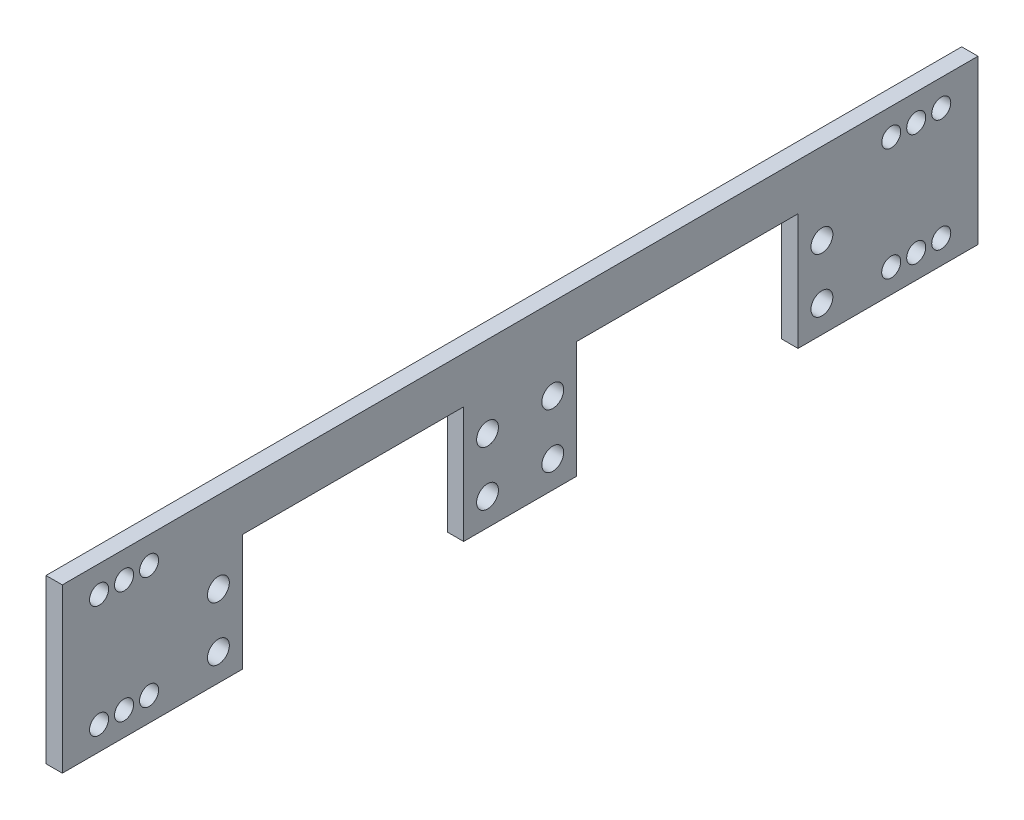
ISO-10303-21;
HEADER;
FILE_DESCRIPTION(('STEP AP214'),'2;1');
FILE_NAME('part.step','',(''),(''),'','','');
FILE_SCHEMA(('AUTOMOTIVE_DESIGN { 1 0 10303 214 1 1 1 1 }'));
ENDSEC;
DATA;
#1=APPLICATION_CONTEXT('core data for automotive mechanical design processes');
#2=APPLICATION_PROTOCOL_DEFINITION('international standard','automotive_design',2000,#1);
#3=PRODUCT_CONTEXT('',#1,'mechanical');
#4=PRODUCT('Part','Part','',(#3));
#5=PRODUCT_RELATED_PRODUCT_CATEGORY('part','',(#4));
#6=PRODUCT_DEFINITION_FORMATION('','',#4);
#7=PRODUCT_DEFINITION_CONTEXT('part definition',#1,'design');
#8=PRODUCT_DEFINITION('design','',#6,#7);
#9=PRODUCT_DEFINITION_SHAPE('','',#8);
#10=(LENGTH_UNIT() NAMED_UNIT(*) SI_UNIT(.MILLI.,.METRE.));
#11=(NAMED_UNIT(*) PLANE_ANGLE_UNIT() SI_UNIT($,.RADIAN.));
#12=(NAMED_UNIT(*) SI_UNIT($,.STERADIAN.) SOLID_ANGLE_UNIT());
#13=UNCERTAINTY_MEASURE_WITH_UNIT(LENGTH_MEASURE(1.E-05),#10,'distance_accuracy_value','');
#14=(GEOMETRIC_REPRESENTATION_CONTEXT(3) GLOBAL_UNCERTAINTY_ASSIGNED_CONTEXT((#13)) GLOBAL_UNIT_ASSIGNED_CONTEXT((#10,
#11,#12)) REPRESENTATION_CONTEXT('',''));
#15=CARTESIAN_POINT('',(0.,0.,0.));
#16=DIRECTION('',(0.,0.,1.));
#17=DIRECTION('',(1.,0.,0.));
#18=AXIS2_PLACEMENT_3D('',#15,#16,#17);
#19=CARTESIAN_POINT('',(3.,21.4565030456069,0.));
#20=DIRECTION('',(0.,1.,0.));
#21=DIRECTION('',(0.,0.,1.));
#22=AXIS2_PLACEMENT_3D('',#19,#20,#21);
#23=PLANE('',#22);
#24=DIRECTION('',(0.,0.,-1.));
#25=VECTOR('',#24,1.);
#26=CARTESIAN_POINT('',(0.,21.4565030456069,0.));
#27=LINE('',#26,#25);
#28=CARTESIAN_POINT('',(0.,21.4565030456069,-10.3935364042109));
#29=VERTEX_POINT('',#28);
#30=CARTESIAN_POINT('',(0.,21.4565030456069,-51.1064635957811));
#31=VERTEX_POINT('',#30);
#32=EDGE_CURVE('E255',#29,#31,#27,.T.);
#33=ORIENTED_EDGE('',*,*,#32,.T.);
#34=DIRECTION('',(-1.,0.,0.));
#35=VECTOR('',#34,1.);
#36=CARTESIAN_POINT('',(3.,21.4565030456069,-51.1064635957811));
#37=LINE('',#36,#35);
#38=CARTESIAN_POINT('',(3.,21.4565030456069,-51.1064635957811));
#39=VERTEX_POINT('',#38);
#40=EDGE_CURVE('E11',#39,#31,#37,.T.);
#41=ORIENTED_EDGE('',*,*,#40,.F.);
#42=DIRECTION('',(0.,0.,-1.));
#43=VECTOR('',#42,1.);
#44=CARTESIAN_POINT('',(3.,21.4565030456069,0.));
#45=LINE('',#44,#43);
#46=CARTESIAN_POINT('',(3.,21.4565030456069,-10.3935364042109));
#47=VERTEX_POINT('',#46);
#48=EDGE_CURVE('E115',#47,#39,#45,.T.);
#49=ORIENTED_EDGE('',*,*,#48,.F.);
#50=DIRECTION('',(-1.,0.,0.));
#51=VECTOR('',#50,1.);
#52=CARTESIAN_POINT('',(3.,21.4565030456069,-10.3935364042109));
#53=LINE('',#52,#51);
#54=EDGE_CURVE('E198',#47,#29,#53,.T.);
#55=ORIENTED_EDGE('',*,*,#54,.T.);
#56=EDGE_LOOP('',(#33,#41,#49,#55));
#57=FACE_BOUND('',#56,.T.);
#58=ADVANCED_FACE('F46',(#57),#23,.F.);
#59=CARTESIAN_POINT('',(3.,0.,-51.1064635957811));
#60=DIRECTION('',(0.,0.,1.));
#61=DIRECTION('',(1.,0.,0.));
#62=AXIS2_PLACEMENT_3D('',#59,#60,#61);
#63=PLANE('',#62);
#64=DIRECTION('',(0.,1.,0.));
#65=VECTOR('',#64,1.);
#66=CARTESIAN_POINT('',(0.,0.,-51.1064635957811));
#67=LINE('',#66,#65);
#68=CARTESIAN_POINT('',(0.,0.,-51.1064635957811));
#69=VERTEX_POINT('',#68);
#70=EDGE_CURVE('E259',#69,#31,#67,.T.);
#71=ORIENTED_EDGE('',*,*,#70,.F.);
#72=DIRECTION('',(-1.,0.,0.));
#73=VECTOR('',#72,1.);
#74=CARTESIAN_POINT('',(3.,0.,-51.1064635957811));
#75=LINE('',#74,#73);
#76=CARTESIAN_POINT('',(3.,0.,-51.1064635957811));
#77=VERTEX_POINT('',#76);
#78=EDGE_CURVE('E56',#77,#69,#75,.T.);
#79=ORIENTED_EDGE('',*,*,#78,.F.);
#80=DIRECTION('',(0.,1.,0.));
#81=VECTOR('',#80,1.);
#82=CARTESIAN_POINT('',(3.,0.,-51.1064635957811));
#83=LINE('',#82,#81);
#84=EDGE_CURVE('E362',#77,#39,#83,.T.);
#85=ORIENTED_EDGE('',*,*,#84,.T.);
#86=ORIENTED_EDGE('',*,*,#40,.T.);
#87=EDGE_LOOP('',(#71,#79,#85,#86));
#88=FACE_BOUND('',#87,.T.);
#89=ADVANCED_FACE('F361',(#88),#63,.T.);
#90=CARTESIAN_POINT('',(3.,0.,0.));
#91=DIRECTION('',(0.,1.,0.));
#92=DIRECTION('',(0.,0.,1.));
#93=AXIS2_PLACEMENT_3D('',#90,#91,#92);
#94=PLANE('',#93);
#95=DIRECTION('',(0.,0.,-1.));
#96=VECTOR('',#95,1.);
#97=CARTESIAN_POINT('',(0.,0.,0.));
#98=LINE('',#97,#96);
#99=CARTESIAN_POINT('',(0.,0.,-84.2099999999956));
#100=VERTEX_POINT('',#99);
#101=EDGE_CURVE('E263',#69,#100,#98,.T.);
#102=ORIENTED_EDGE('',*,*,#101,.T.);
#103=DIRECTION('',(-1.,0.,0.));
#104=VECTOR('',#103,1.);
#105=CARTESIAN_POINT('',(3.,0.,-84.2099999999956));
#106=LINE('',#105,#104);
#107=CARTESIAN_POINT('',(3.,0.,-84.2099999999956));
#108=VERTEX_POINT('',#107);
#109=EDGE_CURVE('E342',#108,#100,#106,.T.);
#110=ORIENTED_EDGE('',*,*,#109,.F.);
#111=DIRECTION('',(0.,0.,-1.));
#112=VECTOR('',#111,1.);
#113=CARTESIAN_POINT('',(3.,0.,0.));
#114=LINE('',#113,#112);
#115=EDGE_CURVE('E352',#77,#108,#114,.T.);
#116=ORIENTED_EDGE('',*,*,#115,.F.);
#117=ORIENTED_EDGE('',*,*,#78,.T.);
#118=EDGE_LOOP('',(#102,#110,#116,#117));
#119=FACE_BOUND('',#118,.T.);
#120=ADVANCED_FACE('F350',(#119),#94,.F.);
#121=CARTESIAN_POINT('',(3.,0.,-84.2099999999956));
#122=DIRECTION('',(0.,0.,1.));
#123=DIRECTION('',(1.,0.,0.));
#124=AXIS2_PLACEMENT_3D('',#121,#122,#123);
#125=PLANE('',#124);
#126=DIRECTION('',(0.,1.,0.));
#127=VECTOR('',#126,1.);
#128=CARTESIAN_POINT('',(0.,0.,-84.2099999999956));
#129=LINE('',#128,#127);
#130=CARTESIAN_POINT('',(0.,29.9999999999999,-84.2099999999956));
#131=VERTEX_POINT('',#130);
#132=EDGE_CURVE('E266',#100,#131,#129,.T.);
#133=ORIENTED_EDGE('',*,*,#132,.T.);
#134=DIRECTION('',(-1.,0.,0.));
#135=VECTOR('',#134,1.);
#136=CARTESIAN_POINT('',(3.,29.9999999999999,-84.2099999999956));
#137=LINE('',#136,#135);
#138=CARTESIAN_POINT('',(3.,29.9999999999999,-84.2099999999956));
#139=VERTEX_POINT('',#138);
#140=EDGE_CURVE('E339',#139,#131,#137,.T.);
#141=ORIENTED_EDGE('',*,*,#140,.F.);
#142=DIRECTION('',(0.,1.,0.));
#143=VECTOR('',#142,1.);
#144=CARTESIAN_POINT('',(3.,0.,-84.2099999999956));
#145=LINE('',#144,#143);
#146=EDGE_CURVE('E394',#108,#139,#145,.T.);
#147=ORIENTED_EDGE('',*,*,#146,.F.);
#148=ORIENTED_EDGE('',*,*,#109,.T.);
#149=EDGE_LOOP('',(#133,#141,#147,#148));
#150=FACE_BOUND('',#149,.T.);
#151=ADVANCED_FACE('F393',(#150),#125,.F.);
#152=CARTESIAN_POINT('',(3.,29.9999999999999,0.));
#153=DIRECTION('',(0.,1.,0.));
#154=DIRECTION('',(0.,0.,1.));
#155=AXIS2_PLACEMENT_3D('',#152,#153,#154);
#156=PLANE('',#155);
#157=DIRECTION('',(0.,0.,-1.));
#158=VECTOR('',#157,1.);
#159=CARTESIAN_POINT('',(0.,29.9999999999999,0.));
#160=LINE('',#159,#158);
#161=CARTESIAN_POINT('',(0.,29.9999999999999,84.2100000000044));
#162=VERTEX_POINT('',#161);
#163=EDGE_CURVE('E270',#162,#131,#160,.T.);
#164=ORIENTED_EDGE('',*,*,#163,.F.);
#165=DIRECTION('',(-1.,0.,0.));
#166=VECTOR('',#165,1.);
#167=CARTESIAN_POINT('',(3.,29.9999999999999,84.2100000000044));
#168=LINE('',#167,#166);
#169=CARTESIAN_POINT('',(3.,29.9999999999999,84.2100000000044));
#170=VERTEX_POINT('',#169);
#171=EDGE_CURVE('E336',#170,#162,#168,.T.);
#172=ORIENTED_EDGE('',*,*,#171,.F.);
#173=DIRECTION('',(0.,0.,-1.));
#174=VECTOR('',#173,1.);
#175=CARTESIAN_POINT('',(3.,29.9999999999999,0.));
#176=LINE('',#175,#174);
#177=EDGE_CURVE('E390',#170,#139,#176,.T.);
#178=ORIENTED_EDGE('',*,*,#177,.T.);
#179=ORIENTED_EDGE('',*,*,#140,.T.);
#180=EDGE_LOOP('',(#164,#172,#178,#179));
#181=FACE_BOUND('',#180,.T.);
#182=ADVANCED_FACE('F388',(#181),#156,.T.);
#183=CARTESIAN_POINT('',(3.,0.,84.2100000000044));
#184=DIRECTION('',(0.,0.,1.));
#185=DIRECTION('',(1.,0.,0.));
#186=AXIS2_PLACEMENT_3D('',#183,#184,#185);
#187=PLANE('',#186);
#188=DIRECTION('',(0.,1.,0.));
#189=VECTOR('',#188,1.);
#190=CARTESIAN_POINT('',(0.,0.,84.2100000000044));
#191=LINE('',#190,#189);
#192=CARTESIAN_POINT('',(0.,0.,84.2100000000044));
#193=VERTEX_POINT('',#192);
#194=EDGE_CURVE('E274',#193,#162,#191,.T.);
#195=ORIENTED_EDGE('',*,*,#194,.F.);
#196=DIRECTION('',(-1.,0.,0.));
#197=VECTOR('',#196,1.);
#198=CARTESIAN_POINT('',(3.,0.,84.2100000000044));
#199=LINE('',#198,#197);
#200=CARTESIAN_POINT('',(3.,0.,84.2100000000044));
#201=VERTEX_POINT('',#200);
#202=EDGE_CURVE('E333',#201,#193,#199,.T.);
#203=ORIENTED_EDGE('',*,*,#202,.F.);
#204=DIRECTION('',(0.,1.,0.));
#205=VECTOR('',#204,1.);
#206=CARTESIAN_POINT('',(3.,0.,84.2100000000044));
#207=LINE('',#206,#205);
#208=EDGE_CURVE('E384',#201,#170,#207,.T.);
#209=ORIENTED_EDGE('',*,*,#208,.T.);
#210=ORIENTED_EDGE('',*,*,#171,.T.);
#211=EDGE_LOOP('',(#195,#203,#209,#210));
#212=FACE_BOUND('',#211,.T.);
#213=ADVANCED_FACE('F381',(#212),#187,.T.);
#214=CARTESIAN_POINT('',(3.,0.,0.));
#215=DIRECTION('',(0.,1.,0.));
#216=DIRECTION('',(0.,0.,1.));
#217=AXIS2_PLACEMENT_3D('',#214,#215,#216);
#218=PLANE('',#217);
#219=DIRECTION('',(0.,0.,-1.));
#220=VECTOR('',#219,1.);
#221=CARTESIAN_POINT('',(0.,0.,0.));
#222=LINE('',#221,#220);
#223=CARTESIAN_POINT('',(0.,0.,51.106463595789));
#224=VERTEX_POINT('',#223);
#225=EDGE_CURVE('E278',#193,#224,#222,.T.);
#226=ORIENTED_EDGE('',*,*,#225,.T.);
#227=DIRECTION('',(-1.,0.,0.));
#228=VECTOR('',#227,1.);
#229=CARTESIAN_POINT('',(3.,0.,51.106463595789));
#230=LINE('',#229,#228);
#231=CARTESIAN_POINT('',(3.,0.,51.106463595789));
#232=VERTEX_POINT('',#231);
#233=EDGE_CURVE('E329',#232,#224,#230,.T.);
#234=ORIENTED_EDGE('',*,*,#233,.F.);
#235=DIRECTION('',(0.,0.,-1.));
#236=VECTOR('',#235,1.);
#237=CARTESIAN_POINT('',(3.,0.,0.));
#238=LINE('',#237,#236);
#239=EDGE_CURVE('E377',#201,#232,#238,.T.);
#240=ORIENTED_EDGE('',*,*,#239,.F.);
#241=ORIENTED_EDGE('',*,*,#202,.T.);
#242=EDGE_LOOP('',(#226,#234,#240,#241));
#243=FACE_BOUND('',#242,.T.);
#244=ADVANCED_FACE('F376',(#243),#218,.F.);
#245=CARTESIAN_POINT('',(3.,0.,51.106463595789));
#246=DIRECTION('',(0.,0.,1.));
#247=DIRECTION('',(1.,0.,0.));
#248=AXIS2_PLACEMENT_3D('',#245,#246,#247);
#249=PLANE('',#248);
#250=DIRECTION('',(0.,1.,0.));
#251=VECTOR('',#250,1.);
#252=CARTESIAN_POINT('',(0.,0.,51.106463595789));
#253=LINE('',#252,#251);
#254=CARTESIAN_POINT('',(0.,21.4565030456069,51.106463595789));
#255=VERTEX_POINT('',#254);
#256=EDGE_CURVE('E281',#224,#255,#253,.T.);
#257=ORIENTED_EDGE('',*,*,#256,.T.);
#258=DIRECTION('',(-1.,0.,0.));
#259=VECTOR('',#258,1.);
#260=CARTESIAN_POINT('',(3.,21.4565030456069,51.106463595789));
#261=LINE('',#260,#259);
#262=CARTESIAN_POINT('',(3.,21.4565030456069,51.106463595789));
#263=VERTEX_POINT('',#262);
#264=EDGE_CURVE('E325',#263,#255,#261,.T.);
#265=ORIENTED_EDGE('',*,*,#264,.F.);
#266=DIRECTION('',(0.,1.,0.));
#267=VECTOR('',#266,1.);
#268=CARTESIAN_POINT('',(3.,0.,51.106463595789));
#269=LINE('',#268,#267);
#270=EDGE_CURVE('E168',#232,#263,#269,.T.);
#271=ORIENTED_EDGE('',*,*,#270,.F.);
#272=ORIENTED_EDGE('',*,*,#233,.T.);
#273=EDGE_LOOP('',(#257,#265,#271,#272));
#274=FACE_BOUND('',#273,.T.);
#275=ADVANCED_FACE('F372',(#274),#249,.F.);
#276=CARTESIAN_POINT('',(3.,21.4565030456069,0.));
#277=DIRECTION('',(0.,1.,0.));
#278=DIRECTION('',(0.,0.,1.));
#279=AXIS2_PLACEMENT_3D('',#276,#277,#278);
#280=PLANE('',#279);
#281=DIRECTION('',(0.,0.,-1.));
#282=VECTOR('',#281,1.);
#283=CARTESIAN_POINT('',(0.,21.4565030456069,0.));
#284=LINE('',#283,#282);
#285=CARTESIAN_POINT('',(0.,21.4565030456069,10.3935364042109));
#286=VERTEX_POINT('',#285);
#287=EDGE_CURVE('E284',#255,#286,#284,.T.);
#288=ORIENTED_EDGE('',*,*,#287,.T.);
#289=DIRECTION('',(-1.,0.,0.));
#290=VECTOR('',#289,1.);
#291=CARTESIAN_POINT('',(3.,21.4565030456069,10.3935364042109));
#292=LINE('',#291,#290);
#293=CARTESIAN_POINT('',(3.,21.4565030456069,10.3935364042109));
#294=VERTEX_POINT('',#293);
#295=EDGE_CURVE('E152',#294,#286,#292,.T.);
#296=ORIENTED_EDGE('',*,*,#295,.F.);
#297=DIRECTION('',(0.,0.,-1.));
#298=VECTOR('',#297,1.);
#299=CARTESIAN_POINT('',(3.,21.4565030456069,0.));
#300=LINE('',#299,#298);
#301=EDGE_CURVE('E162',#263,#294,#300,.T.);
#302=ORIENTED_EDGE('',*,*,#301,.F.);
#303=ORIENTED_EDGE('',*,*,#264,.T.);
#304=EDGE_LOOP('',(#288,#296,#302,#303));
#305=FACE_BOUND('',#304,.T.);
#306=ADVANCED_FACE('F368',(#305),#280,.F.);
#307=CARTESIAN_POINT('',(3.,0.,10.3935364042109));
#308=DIRECTION('',(0.,0.,1.));
#309=DIRECTION('',(1.,0.,0.));
#310=AXIS2_PLACEMENT_3D('',#307,#308,#309);
#311=PLANE('',#310);
#312=DIRECTION('',(0.,1.,0.));
#313=VECTOR('',#312,1.);
#314=CARTESIAN_POINT('',(0.,0.,10.3935364042109));
#315=LINE('',#314,#313);
#316=CARTESIAN_POINT('',(0.,0.,10.3935364042109));
#317=VERTEX_POINT('',#316);
#318=EDGE_CURVE('E150',#317,#286,#315,.T.);
#319=ORIENTED_EDGE('',*,*,#318,.F.);
#320=DIRECTION('',(-1.,0.,0.));
#321=VECTOR('',#320,1.);
#322=CARTESIAN_POINT('',(3.,0.,10.3935364042109));
#323=LINE('',#322,#321);
#324=CARTESIAN_POINT('',(3.,0.,10.3935364042109));
#325=VERTEX_POINT('',#324);
#326=EDGE_CURVE('E144',#325,#317,#323,.T.);
#327=ORIENTED_EDGE('',*,*,#326,.F.);
#328=DIRECTION('',(0.,1.,0.));
#329=VECTOR('',#328,1.);
#330=CARTESIAN_POINT('',(3.,0.,10.3935364042109));
#331=LINE('',#330,#329);
#332=EDGE_CURVE('E148',#325,#294,#331,.T.);
#333=ORIENTED_EDGE('',*,*,#332,.T.);
#334=ORIENTED_EDGE('',*,*,#295,.T.);
#335=EDGE_LOOP('',(#319,#327,#333,#334));
#336=FACE_BOUND('',#335,.T.);
#337=ADVANCED_FACE('F146',(#336),#311,.T.);
#338=CARTESIAN_POINT('',(3.,0.,0.));
#339=DIRECTION('',(0.,1.,0.));
#340=DIRECTION('',(0.,0.,1.));
#341=AXIS2_PLACEMENT_3D('',#338,#339,#340);
#342=PLANE('',#341);
#343=DIRECTION('',(0.,0.,-1.));
#344=VECTOR('',#343,1.);
#345=CARTESIAN_POINT('',(0.,0.,0.));
#346=LINE('',#345,#344);
#347=CARTESIAN_POINT('',(0.,0.,-10.3935364042109));
#348=VERTEX_POINT('',#347);
#349=EDGE_CURVE('E103',#317,#348,#346,.T.);
#350=ORIENTED_EDGE('',*,*,#349,.T.);
#351=DIRECTION('',(-1.,0.,0.));
#352=VECTOR('',#351,1.);
#353=CARTESIAN_POINT('',(3.,0.,-10.3935364042109));
#354=LINE('',#353,#352);
#355=CARTESIAN_POINT('',(3.,0.,-10.3935364042109));
#356=VERTEX_POINT('',#355);
#357=EDGE_CURVE('E153',#356,#348,#354,.T.);
#358=ORIENTED_EDGE('',*,*,#357,.F.);
#359=DIRECTION('',(0.,0.,-1.));
#360=VECTOR('',#359,1.);
#361=CARTESIAN_POINT('',(3.,0.,0.));
#362=LINE('',#361,#360);
#363=EDGE_CURVE('E155',#325,#356,#362,.T.);
#364=ORIENTED_EDGE('',*,*,#363,.F.);
#365=ORIENTED_EDGE('',*,*,#326,.T.);
#366=EDGE_LOOP('',(#350,#358,#364,#365));
#367=FACE_BOUND('',#366,.T.);
#368=ADVANCED_FACE('F156',(#367),#342,.F.);
#369=CARTESIAN_POINT('',(3.,4.40833333333326,-72.8499999999956));
#370=DIRECTION('',(-1.,0.,0.));
#371=DIRECTION('',(0.,0.,1.));
#372=AXIS2_PLACEMENT_3D('',#369,#370,#371);
#373=CYLINDRICAL_SURFACE('',#372,1.74999999999998);
#374=CARTESIAN_POINT('',(3.,4.40833333333326,-72.8499999999956));
#375=DIRECTION('',(1.,0.,0.));
#376=DIRECTION('',(0.,0.,-1.));
#377=AXIS2_PLACEMENT_3D('',#374,#375,#376);
#378=CIRCLE('',#377,1.74999999999998);
#379=CARTESIAN_POINT('',(3.,4.40833333333326,-74.5999999999956));
#380=VERTEX_POINT('',#379);
#381=EDGE_CURVE('E190',#380,#380,#378,.T.);
#382=ORIENTED_EDGE('',*,*,#381,.T.);
#383=EDGE_LOOP('',(#382));
#384=FACE_BOUND('',#383,.T.);
#385=CARTESIAN_POINT('',(0.,4.40833333333326,-72.8499999999956));
#386=DIRECTION('',(1.,0.,0.));
#387=DIRECTION('',(0.,0.,-1.));
#388=AXIS2_PLACEMENT_3D('',#385,#386,#387);
#389=CIRCLE('',#388,1.74999999999998);
#390=CARTESIAN_POINT('',(0.,4.40833333333326,-74.5999999999956));
#391=VERTEX_POINT('',#390);
#392=EDGE_CURVE('E310',#391,#391,#389,.T.);
#393=ORIENTED_EDGE('',*,*,#392,.F.);
#394=EDGE_LOOP('',(#393));
#395=FACE_BOUND('',#394,.T.);
#396=ADVANCED_FACE('F724',(#384,#395),#373,.F.);
#397=CARTESIAN_POINT('',(3.,4.40833333333326,-77.4499999999957));
#398=DIRECTION('',(-1.,0.,0.));
#399=DIRECTION('',(0.,0.,1.));
#400=AXIS2_PLACEMENT_3D('',#397,#398,#399);
#401=CYLINDRICAL_SURFACE('',#400,1.75);
#402=CARTESIAN_POINT('',(3.,4.40833333333326,-77.4499999999957));
#403=DIRECTION('',(1.,0.,0.));
#404=DIRECTION('',(0.,0.,-1.));
#405=AXIS2_PLACEMENT_3D('',#402,#403,#404);
#406=CIRCLE('',#405,1.75);
#407=CARTESIAN_POINT('',(3.,4.40833333333326,-79.1999999999957));
#408=VERTEX_POINT('',#407);
#409=EDGE_CURVE('E186',#408,#408,#406,.T.);
#410=ORIENTED_EDGE('',*,*,#409,.T.);
#411=EDGE_LOOP('',(#410));
#412=FACE_BOUND('',#411,.T.);
#413=CARTESIAN_POINT('',(0.,4.40833333333326,-77.4499999999957));
#414=DIRECTION('',(1.,0.,0.));
#415=DIRECTION('',(0.,0.,-1.));
#416=AXIS2_PLACEMENT_3D('',#413,#414,#415);
#417=CIRCLE('',#416,1.75);
#418=CARTESIAN_POINT('',(0.,4.40833333333326,-79.1999999999957));
#419=VERTEX_POINT('',#418);
#420=EDGE_CURVE('E306',#419,#419,#417,.T.);
#421=ORIENTED_EDGE('',*,*,#420,.F.);
#422=EDGE_LOOP('',(#421));
#423=FACE_BOUND('',#422,.T.);
#424=ADVANCED_FACE('F727',(#412,#423),#401,.F.);
#425=CARTESIAN_POINT('',(3.,25.1116666666666,-77.4499999999957));
#426=DIRECTION('',(-1.,0.,0.));
#427=DIRECTION('',(0.,0.,1.));
#428=AXIS2_PLACEMENT_3D('',#425,#426,#427);
#429=CYLINDRICAL_SURFACE('',#428,1.74999999999998);
#430=CARTESIAN_POINT('',(3.,25.1116666666666,-77.4499999999957));
#431=DIRECTION('',(1.,0.,0.));
#432=DIRECTION('',(0.,0.,-1.));
#433=AXIS2_PLACEMENT_3D('',#430,#431,#432);
#434=CIRCLE('',#433,1.74999999999998);
#435=CARTESIAN_POINT('',(3.,25.1116666666666,-79.1999999999956));
#436=VERTEX_POINT('',#435);
#437=EDGE_CURVE('E182',#436,#436,#434,.T.);
#438=ORIENTED_EDGE('',*,*,#437,.T.);
#439=EDGE_LOOP('',(#438));
#440=FACE_BOUND('',#439,.T.);
#441=CARTESIAN_POINT('',(0.,25.1116666666666,-77.4499999999957));
#442=DIRECTION('',(1.,0.,0.));
#443=DIRECTION('',(0.,0.,-1.));
#444=AXIS2_PLACEMENT_3D('',#441,#442,#443);
#445=CIRCLE('',#444,1.74999999999998);
#446=CARTESIAN_POINT('',(0.,25.1116666666666,-79.1999999999956));
#447=VERTEX_POINT('',#446);
#448=EDGE_CURVE('E302',#447,#447,#445,.T.);
#449=ORIENTED_EDGE('',*,*,#448,.F.);
#450=EDGE_LOOP('',(#449));
#451=FACE_BOUND('',#450,.T.);
#452=ADVANCED_FACE('F731',(#440,#451),#429,.F.);
#453=CARTESIAN_POINT('',(3.,25.1116666666666,-72.8499999999956));
#454=DIRECTION('',(-1.,0.,0.));
#455=DIRECTION('',(0.,0.,1.));
#456=AXIS2_PLACEMENT_3D('',#453,#454,#455);
#457=CYLINDRICAL_SURFACE('',#456,1.75);
#458=CARTESIAN_POINT('',(3.,25.1116666666666,-72.8499999999956));
#459=DIRECTION('',(1.,0.,0.));
#460=DIRECTION('',(0.,0.,-1.));
#461=AXIS2_PLACEMENT_3D('',#458,#459,#460);
#462=CIRCLE('',#461,1.75);
#463=CARTESIAN_POINT('',(3.,25.1116666666666,-74.5999999999956));
#464=VERTEX_POINT('',#463);
#465=EDGE_CURVE('E178',#464,#464,#462,.T.);
#466=ORIENTED_EDGE('',*,*,#465,.T.);
#467=EDGE_LOOP('',(#466));
#468=FACE_BOUND('',#467,.T.);
#469=CARTESIAN_POINT('',(0.,25.1116666666666,-72.8499999999956));
#470=DIRECTION('',(1.,0.,0.));
#471=DIRECTION('',(0.,0.,-1.));
#472=AXIS2_PLACEMENT_3D('',#469,#470,#471);
#473=CIRCLE('',#472,1.75);
#474=CARTESIAN_POINT('',(0.,25.1116666666666,-74.5999999999956));
#475=VERTEX_POINT('',#474);
#476=EDGE_CURVE('E298',#475,#475,#473,.T.);
#477=ORIENTED_EDGE('',*,*,#476,.F.);
#478=EDGE_LOOP('',(#477));
#479=FACE_BOUND('',#478,.T.);
#480=ADVANCED_FACE('F735',(#468,#479),#457,.F.);
#481=CARTESIAN_POINT('',(3.,25.1116666666666,-68.2499999999956));
#482=DIRECTION('',(-1.,0.,0.));
#483=DIRECTION('',(0.,0.,1.));
#484=AXIS2_PLACEMENT_3D('',#481,#482,#483);
#485=CYLINDRICAL_SURFACE('',#484,1.73969428460574);
#486=CARTESIAN_POINT('',(0.,25.1116666666666,-68.2499999999956));
#487=DIRECTION('',(1.,0.,0.));
#488=DIRECTION('',(0.,0.,-1.));
#489=AXIS2_PLACEMENT_3D('',#486,#487,#488);
#490=CIRCLE('',#489,1.73969428460574);
#491=CARTESIAN_POINT('',(0.,25.1116666666666,-69.9896942846014));
#492=VERTEX_POINT('',#491);
#493=EDGE_CURVE('E294',#492,#492,#490,.T.);
#494=ORIENTED_EDGE('',*,*,#493,.F.);
#495=EDGE_LOOP('',(#494));
#496=FACE_BOUND('',#495,.T.);
#497=CARTESIAN_POINT('',(3.,25.1116666666666,-68.2499999999956));
#498=DIRECTION('',(1.,0.,0.));
#499=DIRECTION('',(0.,0.,-1.));
#500=AXIS2_PLACEMENT_3D('',#497,#498,#499);
#501=CIRCLE('',#500,1.73969428460574);
#502=CARTESIAN_POINT('',(3.,25.1116666666666,-69.9896942846014));
#503=VERTEX_POINT('',#502);
#504=EDGE_CURVE('E174',#503,#503,#501,.T.);
#505=ORIENTED_EDGE('',*,*,#504,.T.);
#506=EDGE_LOOP('',(#505));
#507=FACE_BOUND('',#506,.T.);
#508=ADVANCED_FACE('F739',(#496,#507),#485,.F.);
#509=CARTESIAN_POINT('',(3.,0.,-10.3935364042109));
#510=DIRECTION('',(0.,0.,1.));
#511=DIRECTION('',(1.,0.,0.));
#512=AXIS2_PLACEMENT_3D('',#509,#510,#511);
#513=PLANE('',#512);
#514=DIRECTION('',(0.,1.,0.));
#515=VECTOR('',#514,1.);
#516=CARTESIAN_POINT('',(0.,0.,-10.3935364042109));
#517=LINE('',#516,#515);
#518=EDGE_CURVE('E109',#348,#29,#517,.T.);
#519=ORIENTED_EDGE('',*,*,#518,.T.);
#520=ORIENTED_EDGE('',*,*,#54,.F.);
#521=DIRECTION('',(0.,1.,0.));
#522=VECTOR('',#521,1.);
#523=CARTESIAN_POINT('',(3.,0.,-10.3935364042109));
#524=LINE('',#523,#522);
#525=EDGE_CURVE('E64',#356,#47,#524,.T.);
#526=ORIENTED_EDGE('',*,*,#525,.F.);
#527=ORIENTED_EDGE('',*,*,#357,.T.);
#528=EDGE_LOOP('',(#519,#520,#526,#527));
#529=FACE_BOUND('',#528,.T.);
#530=ADVANCED_FACE('F613',(#529),#513,.F.);
#531=CARTESIAN_POINT('',(3.,15.,-5.99999999999547));
#532=DIRECTION('',(-1.,0.,0.));
#533=DIRECTION('',(0.,0.,1.));
#534=AXIS2_PLACEMENT_3D('',#531,#532,#533);
#535=CYLINDRICAL_SURFACE('',#534,2.01000000000027);
#536=CARTESIAN_POINT('',(3.,15.,-5.99999999999547));
#537=DIRECTION('',(1.,0.,0.));
#538=DIRECTION('',(0.,0.,-1.));
#539=AXIS2_PLACEMENT_3D('',#536,#537,#538);
#540=CIRCLE('',#539,2.01000000000027);
#541=CARTESIAN_POINT('',(3.,15.,-8.00999999999574));
#542=VERTEX_POINT('',#541);
#543=EDGE_CURVE('E427',#542,#542,#540,.T.);
#544=ORIENTED_EDGE('',*,*,#543,.T.);
#545=EDGE_LOOP('',(#544));
#546=FACE_BOUND('',#545,.T.);
#547=CARTESIAN_POINT('',(0.,15.,-5.99999999999547));
#548=DIRECTION('',(1.,0.,0.));
#549=DIRECTION('',(0.,0.,-1.));
#550=AXIS2_PLACEMENT_3D('',#547,#548,#549);
#551=CIRCLE('',#550,2.01000000000027);
#552=CARTESIAN_POINT('',(0.,15.,-8.00999999999574));
#553=VERTEX_POINT('',#552);
#554=EDGE_CURVE('E251',#553,#553,#551,.T.);
#555=ORIENTED_EDGE('',*,*,#554,.F.);
#556=EDGE_LOOP('',(#555));
#557=FACE_BOUND('',#556,.T.);
#558=ADVANCED_FACE('F609',(#546,#557),#535,.F.);
#559=CARTESIAN_POINT('',(3.,4.99999999999998,-5.99999999999547));
#560=DIRECTION('',(-1.,0.,0.));
#561=DIRECTION('',(0.,0.,1.));
#562=AXIS2_PLACEMENT_3D('',#559,#560,#561);
#563=CYLINDRICAL_SURFACE('',#562,2.01000000000027);
#564=CARTESIAN_POINT('',(3.,4.99999999999998,-5.99999999999547));
#565=DIRECTION('',(1.,0.,0.));
#566=DIRECTION('',(0.,0.,-1.));
#567=AXIS2_PLACEMENT_3D('',#564,#565,#566);
#568=CIRCLE('',#567,2.01000000000027);
#569=CARTESIAN_POINT('',(3.,4.99999999999998,-8.00999999999574));
#570=VERTEX_POINT('',#569);
#571=EDGE_CURVE('E433',#570,#570,#568,.T.);
#572=ORIENTED_EDGE('',*,*,#571,.T.);
#573=EDGE_LOOP('',(#572));
#574=FACE_BOUND('',#573,.T.);
#575=CARTESIAN_POINT('',(0.,4.99999999999998,-5.99999999999547));
#576=DIRECTION('',(1.,0.,0.));
#577=DIRECTION('',(0.,0.,-1.));
#578=AXIS2_PLACEMENT_3D('',#575,#576,#577);
#579=CIRCLE('',#578,2.01000000000027);
#580=CARTESIAN_POINT('',(0.,4.99999999999998,-8.00999999999574));
#581=VERTEX_POINT('',#580);
#582=EDGE_CURVE('E247',#581,#581,#579,.T.);
#583=ORIENTED_EDGE('',*,*,#582,.F.);
#584=EDGE_LOOP('',(#583));
#585=FACE_BOUND('',#584,.T.);
#586=ADVANCED_FACE('F612',(#574,#585),#563,.F.);
#587=CARTESIAN_POINT('',(3.,15.,5.99999999999538));
#588=DIRECTION('',(-1.,0.,0.));
#589=DIRECTION('',(0.,0.,1.));
#590=AXIS2_PLACEMENT_3D('',#587,#588,#589);
#591=CYLINDRICAL_SURFACE('',#590,2.01000000000025);
#592=CARTESIAN_POINT('',(3.,15.,5.99999999999538));
#593=DIRECTION('',(1.,0.,0.));
#594=DIRECTION('',(0.,0.,-1.));
#595=AXIS2_PLACEMENT_3D('',#592,#593,#594);
#596=CIRCLE('',#595,2.01000000000025);
#597=CARTESIAN_POINT('',(3.,15.,3.98999999999513));
#598=VERTEX_POINT('',#597);
#599=EDGE_CURVE('E439',#598,#598,#596,.T.);
#600=ORIENTED_EDGE('',*,*,#599,.T.);
#601=EDGE_LOOP('',(#600));
#602=FACE_BOUND('',#601,.T.);
#603=CARTESIAN_POINT('',(0.,15.,5.99999999999538));
#604=DIRECTION('',(1.,0.,0.));
#605=DIRECTION('',(0.,0.,-1.));
#606=AXIS2_PLACEMENT_3D('',#603,#604,#605);
#607=CIRCLE('',#606,2.01000000000025);
#608=CARTESIAN_POINT('',(0.,15.,3.98999999999513));
#609=VERTEX_POINT('',#608);
#610=EDGE_CURVE('E243',#609,#609,#607,.T.);
#611=ORIENTED_EDGE('',*,*,#610,.F.);
#612=EDGE_LOOP('',(#611));
#613=FACE_BOUND('',#612,.T.);
#614=ADVANCED_FACE('F634',(#602,#613),#591,.F.);
#615=CARTESIAN_POINT('',(3.,4.99999999999998,5.99999999999538));
#616=DIRECTION('',(-1.,0.,0.));
#617=DIRECTION('',(0.,0.,1.));
#618=AXIS2_PLACEMENT_3D('',#615,#616,#617);
#619=CYLINDRICAL_SURFACE('',#618,2.01000000000027);
#620=CARTESIAN_POINT('',(3.,4.99999999999998,5.99999999999538));
#621=DIRECTION('',(1.,0.,0.));
#622=DIRECTION('',(0.,0.,-1.));
#623=AXIS2_PLACEMENT_3D('',#620,#621,#622);
#624=CIRCLE('',#623,2.01000000000027);
#625=CARTESIAN_POINT('',(3.,4.99999999999998,3.98999999999511));
#626=VERTEX_POINT('',#625);
#627=EDGE_CURVE('E445',#626,#626,#624,.T.);
#628=ORIENTED_EDGE('',*,*,#627,.T.);
#629=EDGE_LOOP('',(#628));
#630=FACE_BOUND('',#629,.T.);
#631=CARTESIAN_POINT('',(0.,4.99999999999998,5.99999999999538));
#632=DIRECTION('',(1.,0.,0.));
#633=DIRECTION('',(0.,0.,-1.));
#634=AXIS2_PLACEMENT_3D('',#631,#632,#633);
#635=CIRCLE('',#634,2.01000000000027);
#636=CARTESIAN_POINT('',(0.,4.99999999999998,3.98999999999511));
#637=VERTEX_POINT('',#636);
#638=EDGE_CURVE('E239',#637,#637,#635,.T.);
#639=ORIENTED_EDGE('',*,*,#638,.F.);
#640=EDGE_LOOP('',(#639));
#641=FACE_BOUND('',#640,.T.);
#642=ADVANCED_FACE('F638',(#630,#641),#619,.F.);
#643=CARTESIAN_POINT('',(3.,4.99999999999998,55.5000000000045));
#644=DIRECTION('',(-1.,0.,0.));
#645=DIRECTION('',(0.,0.,1.));
#646=AXIS2_PLACEMENT_3D('',#643,#644,#645);
#647=CYLINDRICAL_SURFACE('',#646,2.01000000000049);
#648=CARTESIAN_POINT('',(3.,4.99999999999998,55.5000000000045));
#649=DIRECTION('',(1.,0.,0.));
#650=DIRECTION('',(0.,0.,-1.));
#651=AXIS2_PLACEMENT_3D('',#648,#649,#650);
#652=CIRCLE('',#651,2.01000000000049);
#653=CARTESIAN_POINT('',(3.,4.99999999999998,53.490000000004));
#654=VERTEX_POINT('',#653);
#655=EDGE_CURVE('E451',#654,#654,#652,.T.);
#656=ORIENTED_EDGE('',*,*,#655,.T.);
#657=EDGE_LOOP('',(#656));
#658=FACE_BOUND('',#657,.T.);
#659=CARTESIAN_POINT('',(0.,4.99999999999998,55.5000000000045));
#660=DIRECTION('',(1.,0.,0.));
#661=DIRECTION('',(0.,0.,-1.));
#662=AXIS2_PLACEMENT_3D('',#659,#660,#661);
#663=CIRCLE('',#662,2.01000000000049);
#664=CARTESIAN_POINT('',(0.,4.99999999999998,53.490000000004));
#665=VERTEX_POINT('',#664);
#666=EDGE_CURVE('E235',#665,#665,#663,.T.);
#667=ORIENTED_EDGE('',*,*,#666,.F.);
#668=EDGE_LOOP('',(#667));
#669=FACE_BOUND('',#668,.T.);
#670=ADVANCED_FACE('F642',(#658,#669),#647,.F.);
#671=CARTESIAN_POINT('',(3.,15.,55.5000000000045));
#672=DIRECTION('',(-1.,0.,0.));
#673=DIRECTION('',(0.,0.,1.));
#674=AXIS2_PLACEMENT_3D('',#671,#672,#673);
#675=CYLINDRICAL_SURFACE('',#674,2.01000000000025);
#676=CARTESIAN_POINT('',(3.,15.,55.5000000000045));
#677=DIRECTION('',(1.,0.,0.));
#678=DIRECTION('',(0.,0.,-1.));
#679=AXIS2_PLACEMENT_3D('',#676,#677,#678);
#680=CIRCLE('',#679,2.01000000000025);
#681=CARTESIAN_POINT('',(3.,15.,53.4900000000042));
#682=VERTEX_POINT('',#681);
#683=EDGE_CURVE('E457',#682,#682,#680,.T.);
#684=ORIENTED_EDGE('',*,*,#683,.T.);
#685=EDGE_LOOP('',(#684));
#686=FACE_BOUND('',#685,.T.);
#687=CARTESIAN_POINT('',(0.,15.,55.5000000000045));
#688=DIRECTION('',(1.,0.,0.));
#689=DIRECTION('',(0.,0.,-1.));
#690=AXIS2_PLACEMENT_3D('',#687,#688,#689);
#691=CIRCLE('',#690,2.01000000000025);
#692=CARTESIAN_POINT('',(0.,15.,53.4900000000042));
#693=VERTEX_POINT('',#692);
#694=EDGE_CURVE('E231',#693,#693,#691,.T.);
#695=ORIENTED_EDGE('',*,*,#694,.F.);
#696=EDGE_LOOP('',(#695));
#697=FACE_BOUND('',#696,.T.);
#698=ADVANCED_FACE('F646',(#686,#697),#675,.F.);
#699=CARTESIAN_POINT('',(3.,25.1116666666666,68.2500000000043));
#700=DIRECTION('',(-1.,0.,0.));
#701=DIRECTION('',(0.,0.,1.));
#702=AXIS2_PLACEMENT_3D('',#699,#700,#701);
#703=CYLINDRICAL_SURFACE('',#702,1.75);
#704=CARTESIAN_POINT('',(3.,25.1116666666666,68.2500000000043));
#705=DIRECTION('',(1.,0.,0.));
#706=DIRECTION('',(0.,0.,-1.));
#707=AXIS2_PLACEMENT_3D('',#704,#705,#706);
#708=CIRCLE('',#707,1.75);
#709=CARTESIAN_POINT('',(3.,25.1116666666666,66.5000000000043));
#710=VERTEX_POINT('',#709);
#711=EDGE_CURVE('E463',#710,#710,#708,.T.);
#712=ORIENTED_EDGE('',*,*,#711,.T.);
#713=EDGE_LOOP('',(#712));
#714=FACE_BOUND('',#713,.T.);
#715=CARTESIAN_POINT('',(0.,25.1116666666666,68.2500000000043));
#716=DIRECTION('',(1.,0.,0.));
#717=DIRECTION('',(0.,0.,-1.));
#718=AXIS2_PLACEMENT_3D('',#715,#716,#717);
#719=CIRCLE('',#718,1.75);
#720=CARTESIAN_POINT('',(0.,25.1116666666666,66.5000000000043));
#721=VERTEX_POINT('',#720);
#722=EDGE_CURVE('E227',#721,#721,#719,.T.);
#723=ORIENTED_EDGE('',*,*,#722,.F.);
#724=EDGE_LOOP('',(#723));
#725=FACE_BOUND('',#724,.T.);
#726=ADVANCED_FACE('F650',(#714,#725),#703,.F.);
#727=CARTESIAN_POINT('',(3.,25.1116666666666,72.8500000000043));
#728=DIRECTION('',(-1.,0.,0.));
#729=DIRECTION('',(0.,0.,1.));
#730=AXIS2_PLACEMENT_3D('',#727,#728,#729);
#731=CYLINDRICAL_SURFACE('',#730,1.74999999999998);
#732=CARTESIAN_POINT('',(3.,25.1116666666666,72.8500000000043));
#733=DIRECTION('',(1.,0.,0.));
#734=DIRECTION('',(0.,0.,-1.));
#735=AXIS2_PLACEMENT_3D('',#732,#733,#734);
#736=CIRCLE('',#735,1.74999999999998);
#737=CARTESIAN_POINT('',(3.,25.1116666666666,71.1000000000043));
#738=VERTEX_POINT('',#737);
#739=EDGE_CURVE('E469',#738,#738,#736,.T.);
#740=ORIENTED_EDGE('',*,*,#739,.T.);
#741=EDGE_LOOP('',(#740));
#742=FACE_BOUND('',#741,.T.);
#743=CARTESIAN_POINT('',(0.,25.1116666666666,72.8500000000043));
#744=DIRECTION('',(1.,0.,0.));
#745=DIRECTION('',(0.,0.,-1.));
#746=AXIS2_PLACEMENT_3D('',#743,#744,#745);
#747=CIRCLE('',#746,1.74999999999998);
#748=CARTESIAN_POINT('',(0.,25.1116666666666,71.1000000000043));
#749=VERTEX_POINT('',#748);
#750=EDGE_CURVE('E223',#749,#749,#747,.T.);
#751=ORIENTED_EDGE('',*,*,#750,.F.);
#752=EDGE_LOOP('',(#751));
#753=FACE_BOUND('',#752,.T.);
#754=ADVANCED_FACE('F654',(#742,#753),#731,.F.);
#755=CARTESIAN_POINT('',(3.,25.1116666666666,77.4500000000043));
#756=DIRECTION('',(-1.,0.,0.));
#757=DIRECTION('',(0.,0.,1.));
#758=AXIS2_PLACEMENT_3D('',#755,#756,#757);
#759=CYLINDRICAL_SURFACE('',#758,1.75000000000001);
#760=CARTESIAN_POINT('',(3.,25.1116666666666,77.4500000000043));
#761=DIRECTION('',(1.,0.,0.));
#762=DIRECTION('',(0.,0.,-1.));
#763=AXIS2_PLACEMENT_3D('',#760,#761,#762);
#764=CIRCLE('',#763,1.75000000000001);
#765=CARTESIAN_POINT('',(3.,25.1116666666666,75.7000000000043));
#766=VERTEX_POINT('',#765);
#767=EDGE_CURVE('E475',#766,#766,#764,.T.);
#768=ORIENTED_EDGE('',*,*,#767,.T.);
#769=EDGE_LOOP('',(#768));
#770=FACE_BOUND('',#769,.T.);
#771=CARTESIAN_POINT('',(0.,25.1116666666666,77.4500000000043));
#772=DIRECTION('',(1.,0.,0.));
#773=DIRECTION('',(0.,0.,-1.));
#774=AXIS2_PLACEMENT_3D('',#771,#772,#773);
#775=CIRCLE('',#774,1.75000000000001);
#776=CARTESIAN_POINT('',(0.,25.1116666666666,75.7000000000043));
#777=VERTEX_POINT('',#776);
#778=EDGE_CURVE('E219',#777,#777,#775,.T.);
#779=ORIENTED_EDGE('',*,*,#778,.F.);
#780=EDGE_LOOP('',(#779));
#781=FACE_BOUND('',#780,.T.);
#782=ADVANCED_FACE('F658',(#770,#781),#759,.F.);
#783=CARTESIAN_POINT('',(3.,4.40833333333326,68.2500000000043));
#784=DIRECTION('',(-1.,0.,0.));
#785=DIRECTION('',(0.,0.,1.));
#786=AXIS2_PLACEMENT_3D('',#783,#784,#785);
#787=CYLINDRICAL_SURFACE('',#786,1.74999999999998);
#788=CARTESIAN_POINT('',(3.,4.40833333333326,68.2500000000043));
#789=DIRECTION('',(1.,0.,0.));
#790=DIRECTION('',(0.,0.,-1.));
#791=AXIS2_PLACEMENT_3D('',#788,#789,#790);
#792=CIRCLE('',#791,1.74999999999998);
#793=CARTESIAN_POINT('',(3.,4.40833333333326,66.5000000000044));
#794=VERTEX_POINT('',#793);
#795=EDGE_CURVE('E481',#794,#794,#792,.T.);
#796=ORIENTED_EDGE('',*,*,#795,.T.);
#797=EDGE_LOOP('',(#796));
#798=FACE_BOUND('',#797,.T.);
#799=CARTESIAN_POINT('',(0.,4.40833333333326,68.2500000000043));
#800=DIRECTION('',(1.,0.,0.));
#801=DIRECTION('',(0.,0.,-1.));
#802=AXIS2_PLACEMENT_3D('',#799,#800,#801);
#803=CIRCLE('',#802,1.74999999999998);
#804=CARTESIAN_POINT('',(0.,4.40833333333326,66.5000000000044));
#805=VERTEX_POINT('',#804);
#806=EDGE_CURVE('E215',#805,#805,#803,.T.);
#807=ORIENTED_EDGE('',*,*,#806,.F.);
#808=EDGE_LOOP('',(#807));
#809=FACE_BOUND('',#808,.T.);
#810=ADVANCED_FACE('F662',(#798,#809),#787,.F.);
#811=CARTESIAN_POINT('',(3.,4.40833333333326,72.8500000000043));
#812=DIRECTION('',(-1.,0.,0.));
#813=DIRECTION('',(0.,0.,1.));
#814=AXIS2_PLACEMENT_3D('',#811,#812,#813);
#815=CYLINDRICAL_SURFACE('',#814,1.75);
#816=CARTESIAN_POINT('',(3.,4.40833333333326,72.8500000000043));
#817=DIRECTION('',(1.,0.,0.));
#818=DIRECTION('',(0.,0.,-1.));
#819=AXIS2_PLACEMENT_3D('',#816,#817,#818);
#820=CIRCLE('',#819,1.75);
#821=CARTESIAN_POINT('',(3.,4.40833333333326,71.1000000000043));
#822=VERTEX_POINT('',#821);
#823=EDGE_CURVE('E487',#822,#822,#820,.T.);
#824=ORIENTED_EDGE('',*,*,#823,.T.);
#825=EDGE_LOOP('',(#824));
#826=FACE_BOUND('',#825,.T.);
#827=CARTESIAN_POINT('',(0.,4.40833333333326,72.8500000000043));
#828=DIRECTION('',(1.,0.,0.));
#829=DIRECTION('',(0.,0.,-1.));
#830=AXIS2_PLACEMENT_3D('',#827,#828,#829);
#831=CIRCLE('',#830,1.75);
#832=CARTESIAN_POINT('',(0.,4.40833333333326,71.1000000000043));
#833=VERTEX_POINT('',#832);
#834=EDGE_CURVE('E211',#833,#833,#831,.T.);
#835=ORIENTED_EDGE('',*,*,#834,.F.);
#836=EDGE_LOOP('',(#835));
#837=FACE_BOUND('',#836,.T.);
#838=ADVANCED_FACE('F666',(#826,#837),#815,.F.);
#839=CARTESIAN_POINT('',(3.,4.40833333333326,77.4500000000044));
#840=DIRECTION('',(-1.,0.,0.));
#841=DIRECTION('',(0.,0.,1.));
#842=AXIS2_PLACEMENT_3D('',#839,#840,#841);
#843=CYLINDRICAL_SURFACE('',#842,1.75000000000001);
#844=CARTESIAN_POINT('',(3.,4.40833333333326,77.4500000000044));
#845=DIRECTION('',(1.,0.,0.));
#846=DIRECTION('',(0.,0.,-1.));
#847=AXIS2_PLACEMENT_3D('',#844,#845,#846);
#848=CIRCLE('',#847,1.75000000000001);
#849=CARTESIAN_POINT('',(3.,4.40833333333326,75.7000000000043));
#850=VERTEX_POINT('',#849);
#851=EDGE_CURVE('E493',#850,#850,#848,.T.);
#852=ORIENTED_EDGE('',*,*,#851,.T.);
#853=EDGE_LOOP('',(#852));
#854=FACE_BOUND('',#853,.T.);
#855=CARTESIAN_POINT('',(0.,4.40833333333326,77.4500000000044));
#856=DIRECTION('',(1.,0.,0.));
#857=DIRECTION('',(0.,0.,-1.));
#858=AXIS2_PLACEMENT_3D('',#855,#856,#857);
#859=CIRCLE('',#858,1.75000000000001);
#860=CARTESIAN_POINT('',(0.,4.40833333333326,75.7000000000043));
#861=VERTEX_POINT('',#860);
#862=EDGE_CURVE('E207',#861,#861,#859,.T.);
#863=ORIENTED_EDGE('',*,*,#862,.F.);
#864=EDGE_LOOP('',(#863));
#865=FACE_BOUND('',#864,.T.);
#866=ADVANCED_FACE('F670',(#854,#865),#843,.F.);
#867=CARTESIAN_POINT('',(3.,15.,-55.4999999999966));
#868=DIRECTION('',(-1.,0.,0.));
#869=DIRECTION('',(0.,0.,1.));
#870=AXIS2_PLACEMENT_3D('',#867,#868,#869);
#871=CYLINDRICAL_SURFACE('',#870,2.0100000000005);
#872=CARTESIAN_POINT('',(3.,15.,-55.4999999999966));
#873=DIRECTION('',(1.,0.,0.));
#874=DIRECTION('',(0.,0.,-1.));
#875=AXIS2_PLACEMENT_3D('',#872,#873,#874);
#876=CIRCLE('',#875,2.0100000000005);
#877=CARTESIAN_POINT('',(3.,15.,-57.5099999999971));
#878=VERTEX_POINT('',#877);
#879=EDGE_CURVE('E499',#878,#878,#876,.T.);
#880=ORIENTED_EDGE('',*,*,#879,.T.);
#881=EDGE_LOOP('',(#880));
#882=FACE_BOUND('',#881,.T.);
#883=CARTESIAN_POINT('',(0.,15.,-55.4999999999966));
#884=DIRECTION('',(1.,0.,0.));
#885=DIRECTION('',(0.,0.,-1.));
#886=AXIS2_PLACEMENT_3D('',#883,#884,#885);
#887=CIRCLE('',#886,2.0100000000005);
#888=CARTESIAN_POINT('',(0.,15.,-57.5099999999971));
#889=VERTEX_POINT('',#888);
#890=EDGE_CURVE('E203',#889,#889,#887,.T.);
#891=ORIENTED_EDGE('',*,*,#890,.F.);
#892=EDGE_LOOP('',(#891));
#893=FACE_BOUND('',#892,.T.);
#894=ADVANCED_FACE('F673',(#882,#893),#871,.F.);
#895=CARTESIAN_POINT('',(3.,4.99999999999998,-55.4999999999966));
#896=DIRECTION('',(-1.,0.,0.));
#897=DIRECTION('',(0.,0.,1.));
#898=AXIS2_PLACEMENT_3D('',#895,#896,#897);
#899=CYLINDRICAL_SURFACE('',#898,2.01000000000027);
#900=CARTESIAN_POINT('',(3.,4.99999999999998,-55.4999999999966));
#901=DIRECTION('',(1.,0.,0.));
#902=DIRECTION('',(0.,0.,-1.));
#903=AXIS2_PLACEMENT_3D('',#900,#901,#902);
#904=CIRCLE('',#903,2.01000000000027);
#905=CARTESIAN_POINT('',(3.,4.99999999999998,-57.5099999999969));
#906=VERTEX_POINT('',#905);
#907=EDGE_CURVE('E318',#906,#906,#904,.T.);
#908=ORIENTED_EDGE('',*,*,#907,.T.);
#909=EDGE_LOOP('',(#908));
#910=FACE_BOUND('',#909,.T.);
#911=CARTESIAN_POINT('',(0.,4.99999999999998,-55.4999999999966));
#912=DIRECTION('',(1.,0.,0.));
#913=DIRECTION('',(0.,0.,-1.));
#914=AXIS2_PLACEMENT_3D('',#911,#912,#913);
#915=CIRCLE('',#914,2.01000000000027);
#916=CARTESIAN_POINT('',(0.,4.99999999999998,-57.5099999999969));
#917=VERTEX_POINT('',#916);
#918=EDGE_CURVE('E199',#917,#917,#915,.T.);
#919=ORIENTED_EDGE('',*,*,#918,.F.);
#920=EDGE_LOOP('',(#919));
#921=FACE_BOUND('',#920,.T.);
#922=ADVANCED_FACE('F48',(#910,#921),#899,.F.);
#923=CARTESIAN_POINT('',(3.,4.40833333333327,-68.2499999999956));
#924=DIRECTION('',(-1.,0.,0.));
#925=DIRECTION('',(0.,0.,1.));
#926=AXIS2_PLACEMENT_3D('',#923,#924,#925);
#927=CYLINDRICAL_SURFACE('',#926,1.75000000000001);
#928=CARTESIAN_POINT('',(3.,4.40833333333327,-68.2499999999956));
#929=DIRECTION('',(1.,0.,0.));
#930=DIRECTION('',(0.,0.,-1.));
#931=AXIS2_PLACEMENT_3D('',#928,#929,#930);
#932=CIRCLE('',#931,1.75000000000001);
#933=CARTESIAN_POINT('',(3.,4.40833333333327,-69.9999999999957));
#934=VERTEX_POINT('',#933);
#935=EDGE_CURVE('E194',#934,#934,#932,.T.);
#936=ORIENTED_EDGE('',*,*,#935,.T.);
#937=EDGE_LOOP('',(#936));
#938=FACE_BOUND('',#937,.T.);
#939=CARTESIAN_POINT('',(0.,4.40833333333327,-68.2499999999956));
#940=DIRECTION('',(1.,0.,0.));
#941=DIRECTION('',(0.,0.,-1.));
#942=AXIS2_PLACEMENT_3D('',#939,#940,#941);
#943=CIRCLE('',#942,1.75000000000001);
#944=CARTESIAN_POINT('',(0.,4.40833333333327,-69.9999999999957));
#945=VERTEX_POINT('',#944);
#946=EDGE_CURVE('E314',#945,#945,#943,.T.);
#947=ORIENTED_EDGE('',*,*,#946,.F.);
#948=EDGE_LOOP('',(#947));
#949=FACE_BOUND('',#948,.T.);
#950=ADVANCED_FACE('F580',(#938,#949),#927,.F.);
#951=CARTESIAN_POINT('',(3.,0.,0.));
#952=DIRECTION('',(1.,0.,0.));
#953=DIRECTION('',(0.,0.,-1.));
#954=AXIS2_PLACEMENT_3D('',#951,#952,#953);
#955=PLANE('',#954);
#956=ORIENTED_EDGE('',*,*,#504,.F.);
#957=EDGE_LOOP('',(#956));
#958=FACE_BOUND('',#957,.T.);
#959=ORIENTED_EDGE('',*,*,#907,.F.);
#960=EDGE_LOOP('',(#959));
#961=FACE_BOUND('',#960,.T.);
#962=ORIENTED_EDGE('',*,*,#879,.F.);
#963=EDGE_LOOP('',(#962));
#964=FACE_BOUND('',#963,.T.);
#965=ORIENTED_EDGE('',*,*,#851,.F.);
#966=EDGE_LOOP('',(#965));
#967=FACE_BOUND('',#966,.T.);
#968=ORIENTED_EDGE('',*,*,#823,.F.);
#969=EDGE_LOOP('',(#968));
#970=FACE_BOUND('',#969,.T.);
#971=ORIENTED_EDGE('',*,*,#795,.F.);
#972=EDGE_LOOP('',(#971));
#973=FACE_BOUND('',#972,.T.);
#974=ORIENTED_EDGE('',*,*,#767,.F.);
#975=EDGE_LOOP('',(#974));
#976=FACE_BOUND('',#975,.T.);
#977=ORIENTED_EDGE('',*,*,#739,.F.);
#978=EDGE_LOOP('',(#977));
#979=FACE_BOUND('',#978,.T.);
#980=ORIENTED_EDGE('',*,*,#711,.F.);
#981=EDGE_LOOP('',(#980));
#982=FACE_BOUND('',#981,.T.);
#983=ORIENTED_EDGE('',*,*,#683,.F.);
#984=EDGE_LOOP('',(#983));
#985=FACE_BOUND('',#984,.T.);
#986=ORIENTED_EDGE('',*,*,#655,.F.);
#987=EDGE_LOOP('',(#986));
#988=FACE_BOUND('',#987,.T.);
#989=ORIENTED_EDGE('',*,*,#627,.F.);
#990=EDGE_LOOP('',(#989));
#991=FACE_BOUND('',#990,.T.);
#992=ORIENTED_EDGE('',*,*,#599,.F.);
#993=EDGE_LOOP('',(#992));
#994=FACE_BOUND('',#993,.T.);
#995=ORIENTED_EDGE('',*,*,#571,.F.);
#996=EDGE_LOOP('',(#995));
#997=FACE_BOUND('',#996,.T.);
#998=ORIENTED_EDGE('',*,*,#543,.F.);
#999=EDGE_LOOP('',(#998));
#1000=FACE_BOUND('',#999,.T.);
#1001=ORIENTED_EDGE('',*,*,#48,.T.);
#1002=ORIENTED_EDGE('',*,*,#84,.F.);
#1003=ORIENTED_EDGE('',*,*,#115,.T.);
#1004=ORIENTED_EDGE('',*,*,#146,.T.);
#1005=ORIENTED_EDGE('',*,*,#177,.F.);
#1006=ORIENTED_EDGE('',*,*,#208,.F.);
#1007=ORIENTED_EDGE('',*,*,#239,.T.);
#1008=ORIENTED_EDGE('',*,*,#270,.T.);
#1009=ORIENTED_EDGE('',*,*,#301,.T.);
#1010=ORIENTED_EDGE('',*,*,#332,.F.);
#1011=ORIENTED_EDGE('',*,*,#363,.T.);
#1012=ORIENTED_EDGE('',*,*,#525,.T.);
#1013=EDGE_LOOP('',(#1001,#1002,#1003,#1004,#1005,#1006,#1007,#1008,#1009,#1010,#1011,#1012));
#1014=FACE_BOUND('',#1013,.T.);
#1015=ORIENTED_EDGE('',*,*,#465,.F.);
#1016=EDGE_LOOP('',(#1015));
#1017=FACE_BOUND('',#1016,.T.);
#1018=ORIENTED_EDGE('',*,*,#437,.F.);
#1019=EDGE_LOOP('',(#1018));
#1020=FACE_BOUND('',#1019,.T.);
#1021=ORIENTED_EDGE('',*,*,#409,.F.);
#1022=EDGE_LOOP('',(#1021));
#1023=FACE_BOUND('',#1022,.T.);
#1024=ORIENTED_EDGE('',*,*,#381,.F.);
#1025=EDGE_LOOP('',(#1024));
#1026=FACE_BOUND('',#1025,.T.);
#1027=ORIENTED_EDGE('',*,*,#935,.F.);
#1028=EDGE_LOOP('',(#1027));
#1029=FACE_BOUND('',#1028,.T.);
#1030=ADVANCED_FACE('F159',(#958,#961,#964,#967,#970,#973,#976,#979,#982,#985,#988,#991,#994,
#997,#1000,#1014,#1017,#1020,#1023,#1026,#1029),#955,.T.);
#1031=CARTESIAN_POINT('',(0.,0.,0.));
#1032=DIRECTION('',(1.,0.,0.));
#1033=DIRECTION('',(0.,0.,-1.));
#1034=AXIS2_PLACEMENT_3D('',#1031,#1032,#1033);
#1035=PLANE('',#1034);
#1036=ORIENTED_EDGE('',*,*,#493,.T.);
#1037=EDGE_LOOP('',(#1036));
#1038=FACE_BOUND('',#1037,.T.);
#1039=ORIENTED_EDGE('',*,*,#918,.T.);
#1040=EDGE_LOOP('',(#1039));
#1041=FACE_BOUND('',#1040,.T.);
#1042=ORIENTED_EDGE('',*,*,#890,.T.);
#1043=EDGE_LOOP('',(#1042));
#1044=FACE_BOUND('',#1043,.T.);
#1045=ORIENTED_EDGE('',*,*,#862,.T.);
#1046=EDGE_LOOP('',(#1045));
#1047=FACE_BOUND('',#1046,.T.);
#1048=ORIENTED_EDGE('',*,*,#834,.T.);
#1049=EDGE_LOOP('',(#1048));
#1050=FACE_BOUND('',#1049,.T.);
#1051=ORIENTED_EDGE('',*,*,#806,.T.);
#1052=EDGE_LOOP('',(#1051));
#1053=FACE_BOUND('',#1052,.T.);
#1054=ORIENTED_EDGE('',*,*,#778,.T.);
#1055=EDGE_LOOP('',(#1054));
#1056=FACE_BOUND('',#1055,.T.);
#1057=ORIENTED_EDGE('',*,*,#750,.T.);
#1058=EDGE_LOOP('',(#1057));
#1059=FACE_BOUND('',#1058,.T.);
#1060=ORIENTED_EDGE('',*,*,#722,.T.);
#1061=EDGE_LOOP('',(#1060));
#1062=FACE_BOUND('',#1061,.T.);
#1063=ORIENTED_EDGE('',*,*,#694,.T.);
#1064=EDGE_LOOP('',(#1063));
#1065=FACE_BOUND('',#1064,.T.);
#1066=ORIENTED_EDGE('',*,*,#666,.T.);
#1067=EDGE_LOOP('',(#1066));
#1068=FACE_BOUND('',#1067,.T.);
#1069=ORIENTED_EDGE('',*,*,#638,.T.);
#1070=EDGE_LOOP('',(#1069));
#1071=FACE_BOUND('',#1070,.T.);
#1072=ORIENTED_EDGE('',*,*,#610,.T.);
#1073=EDGE_LOOP('',(#1072));
#1074=FACE_BOUND('',#1073,.T.);
#1075=ORIENTED_EDGE('',*,*,#582,.T.);
#1076=EDGE_LOOP('',(#1075));
#1077=FACE_BOUND('',#1076,.T.);
#1078=ORIENTED_EDGE('',*,*,#554,.T.);
#1079=EDGE_LOOP('',(#1078));
#1080=FACE_BOUND('',#1079,.T.);
#1081=ORIENTED_EDGE('',*,*,#32,.F.);
#1082=ORIENTED_EDGE('',*,*,#518,.F.);
#1083=ORIENTED_EDGE('',*,*,#349,.F.);
#1084=ORIENTED_EDGE('',*,*,#318,.T.);
#1085=ORIENTED_EDGE('',*,*,#287,.F.);
#1086=ORIENTED_EDGE('',*,*,#256,.F.);
#1087=ORIENTED_EDGE('',*,*,#225,.F.);
#1088=ORIENTED_EDGE('',*,*,#194,.T.);
#1089=ORIENTED_EDGE('',*,*,#163,.T.);
#1090=ORIENTED_EDGE('',*,*,#132,.F.);
#1091=ORIENTED_EDGE('',*,*,#101,.F.);
#1092=ORIENTED_EDGE('',*,*,#70,.T.);
#1093=EDGE_LOOP('',(#1081,#1082,#1083,#1084,#1085,#1086,#1087,#1088,#1089,#1090,#1091,#1092));
#1094=FACE_BOUND('',#1093,.T.);
#1095=ORIENTED_EDGE('',*,*,#476,.T.);
#1096=EDGE_LOOP('',(#1095));
#1097=FACE_BOUND('',#1096,.T.);
#1098=ORIENTED_EDGE('',*,*,#448,.T.);
#1099=EDGE_LOOP('',(#1098));
#1100=FACE_BOUND('',#1099,.T.);
#1101=ORIENTED_EDGE('',*,*,#420,.T.);
#1102=EDGE_LOOP('',(#1101));
#1103=FACE_BOUND('',#1102,.T.);
#1104=ORIENTED_EDGE('',*,*,#392,.T.);
#1105=EDGE_LOOP('',(#1104));
#1106=FACE_BOUND('',#1105,.T.);
#1107=ORIENTED_EDGE('',*,*,#946,.T.);
#1108=EDGE_LOOP('',(#1107));
#1109=FACE_BOUND('',#1108,.T.);
#1110=ADVANCED_FACE('F359',(#1038,#1041,#1044,#1047,#1050,#1053,#1056,#1059,#1062,#1065,#1068,
#1071,#1074,#1077,#1080,#1094,#1097,#1100,#1103,#1106,#1109),#1035,.F.);
#1111=CLOSED_SHELL('',(#58,#89,#120,#151,#182,#213,#244,#275,#306,#337,#368,#396,#424,#452,#480,
#508,#530,#558,#586,#614,#642,#670,#698,#726,#754,#782,#810,#838,#866,#894,#922,#950,#1030,#1110));
#1112=MANIFOLD_SOLID_BREP('B2',#1111);
#1113=ADVANCED_BREP_SHAPE_REPRESENTATION('',(#18,#1112),#14);
#1114=SHAPE_DEFINITION_REPRESENTATION(#9,#1113);
ENDSEC;
END-ISO-10303-21;
